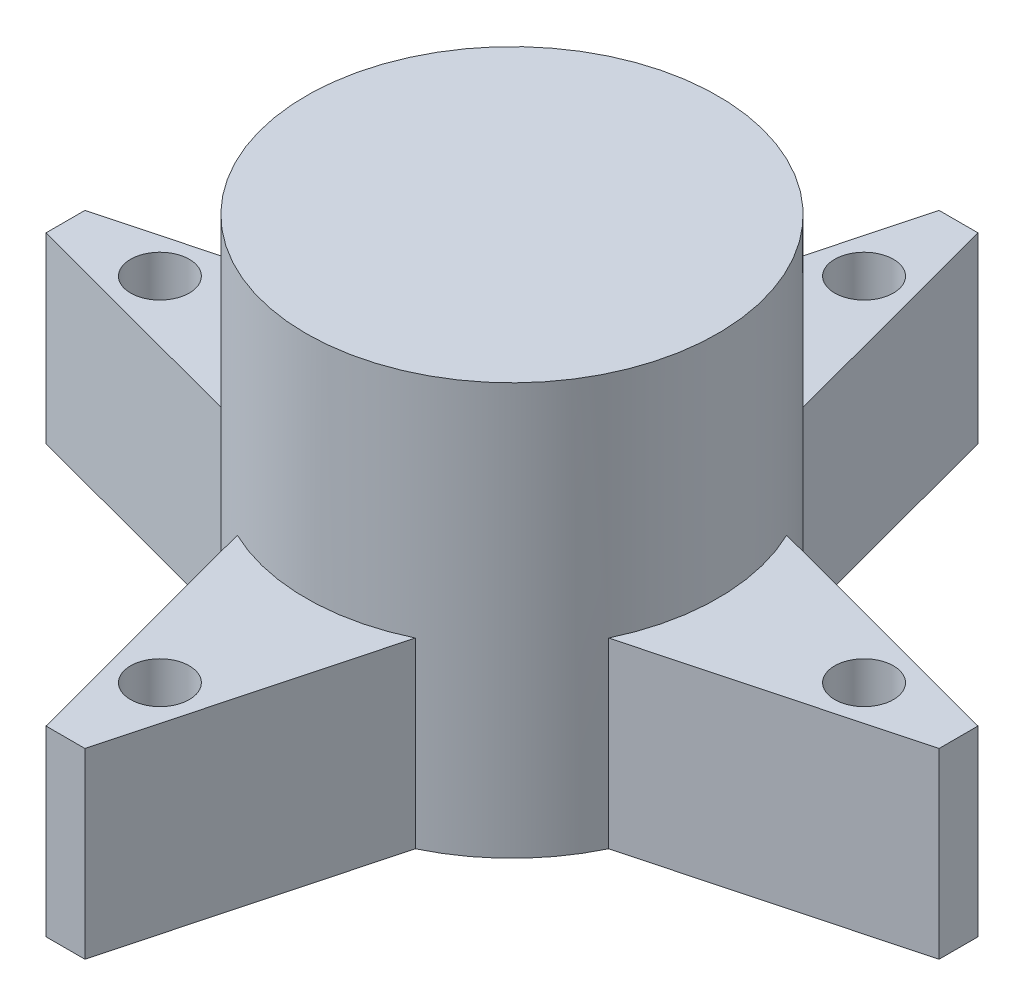
ISO-10303-21;
HEADER;
FILE_DESCRIPTION(('STEP AP214'),'2;1');
FILE_NAME('part.step','',(''),(''),'','','');
FILE_SCHEMA(('AUTOMOTIVE_DESIGN { 1 0 10303 214 1 1 1 1 }'));
ENDSEC;
DATA;
#1=APPLICATION_CONTEXT('core data for automotive mechanical design processes');
#2=APPLICATION_PROTOCOL_DEFINITION('international standard','automotive_design',2000,#1);
#3=PRODUCT_CONTEXT('',#1,'mechanical');
#4=PRODUCT('Part','Part','',(#3));
#5=PRODUCT_RELATED_PRODUCT_CATEGORY('part','',(#4));
#6=PRODUCT_DEFINITION_FORMATION('','',#4);
#7=PRODUCT_DEFINITION_CONTEXT('part definition',#1,'design');
#8=PRODUCT_DEFINITION('design','',#6,#7);
#9=PRODUCT_DEFINITION_SHAPE('','',#8);
#10=(LENGTH_UNIT() NAMED_UNIT(*) SI_UNIT(.MILLI.,.METRE.));
#11=(NAMED_UNIT(*) PLANE_ANGLE_UNIT() SI_UNIT($,.RADIAN.));
#12=(NAMED_UNIT(*) SI_UNIT($,.STERADIAN.) SOLID_ANGLE_UNIT());
#13=UNCERTAINTY_MEASURE_WITH_UNIT(LENGTH_MEASURE(1.E-05),#10,'distance_accuracy_value','');
#14=(GEOMETRIC_REPRESENTATION_CONTEXT(3) GLOBAL_UNCERTAINTY_ASSIGNED_CONTEXT((#13)) GLOBAL_UNIT_ASSIGNED_CONTEXT((#10,
#11,#12)) REPRESENTATION_CONTEXT('',''));
#15=CARTESIAN_POINT('',(0.,0.,0.));
#16=DIRECTION('',(0.,0.,1.));
#17=DIRECTION('',(1.,0.,0.));
#18=AXIS2_PLACEMENT_3D('',#15,#16,#17);
#19=CARTESIAN_POINT('',(0.,15.79,0.));
#20=DIRECTION('',(0.,-1.,0.));
#21=DIRECTION('',(0.,0.,-1.));
#22=AXIS2_PLACEMENT_3D('',#19,#20,#21);
#23=CYLINDRICAL_SURFACE('',#22,7.895);
#24=CARTESIAN_POINT('',(0.,15.79,0.));
#25=DIRECTION('',(0.,1.,0.));
#26=DIRECTION('',(0.,0.,1.));
#27=AXIS2_PLACEMENT_3D('',#24,#25,#26);
#28=CIRCLE('',#27,7.895);
#29=CARTESIAN_POINT('',(0.,15.79,7.895));
#30=VERTEX_POINT('',#29);
#31=EDGE_CURVE('E256',#30,#30,#28,.T.);
#32=ORIENTED_EDGE('',*,*,#31,.F.);
#33=EDGE_LOOP('',(#32));
#34=FACE_BOUND('',#33,.T.);
#35=DIRECTION('',(0.,-1.,0.));
#36=VECTOR('',#35,1.);
#37=CARTESIAN_POINT('',(7.1189256880961,7.,3.4134911816739));
#38=LINE('',#37,#36);
#39=CARTESIAN_POINT('',(7.1189256880961,7.,3.4134911816739));
#40=VERTEX_POINT('',#39);
#41=CARTESIAN_POINT('',(7.1189256880961,0.,3.4134911816739));
#42=VERTEX_POINT('',#41);
#43=EDGE_CURVE('E49',#40,#42,#38,.T.);
#44=ORIENTED_EDGE('',*,*,#43,.F.);
#45=CARTESIAN_POINT('',(0.,7.,0.));
#46=DIRECTION('',(0.,1.,0.));
#47=DIRECTION('',(0.,0.,1.));
#48=AXIS2_PLACEMENT_3D('',#45,#46,#47);
#49=CIRCLE('',#48,7.895);
#50=CARTESIAN_POINT('',(7.1189256880961,7.,-3.4134911816739));
#51=VERTEX_POINT('',#50);
#52=EDGE_CURVE('E11',#40,#51,#49,.T.);
#53=ORIENTED_EDGE('',*,*,#52,.T.);
#54=DIRECTION('',(0.,-1.,0.));
#55=VECTOR('',#54,1.);
#56=CARTESIAN_POINT('',(7.1189256880961,7.,-3.4134911816739));
#57=LINE('',#56,#55);
#58=CARTESIAN_POINT('',(7.1189256880961,0.,-3.41349118167389));
#59=VERTEX_POINT('',#58);
#60=EDGE_CURVE('E251',#51,#59,#57,.T.);
#61=ORIENTED_EDGE('',*,*,#60,.T.);
#62=CARTESIAN_POINT('',(0.,0.,0.));
#63=DIRECTION('',(0.,1.,0.));
#64=DIRECTION('',(0.,0.,1.));
#65=AXIS2_PLACEMENT_3D('',#62,#63,#64);
#66=CIRCLE('',#65,7.895);
#67=CARTESIAN_POINT('',(3.41349118167397,0.,-7.11892568809607));
#68=VERTEX_POINT('',#67);
#69=EDGE_CURVE('E259',#59,#68,#66,.T.);
#70=ORIENTED_EDGE('',*,*,#69,.T.);
#71=DIRECTION('',(0.,-1.,0.));
#72=VECTOR('',#71,1.);
#73=CARTESIAN_POINT('',(3.41349118167397,7.,-7.11892568809607));
#74=LINE('',#73,#72);
#75=CARTESIAN_POINT('',(3.41349118167397,7.,-7.11892568809606));
#76=VERTEX_POINT('',#75);
#77=EDGE_CURVE('E56',#76,#68,#74,.T.);
#78=ORIENTED_EDGE('',*,*,#77,.F.);
#79=CARTESIAN_POINT('',(-3.41349118167382,7.,-7.11892568809614));
#80=VERTEX_POINT('',#79);
#81=EDGE_CURVE('E43',#76,#80,#49,.T.);
#82=ORIENTED_EDGE('',*,*,#81,.T.);
#83=DIRECTION('',(0.,-1.,0.));
#84=VECTOR('',#83,1.);
#85=CARTESIAN_POINT('',(-3.41349118167382,7.,-7.11892568809614));
#86=LINE('',#85,#84);
#87=CARTESIAN_POINT('',(-3.41349118167382,0.,-7.11892568809614));
#88=VERTEX_POINT('',#87);
#89=EDGE_CURVE('E242',#80,#88,#86,.T.);
#90=ORIENTED_EDGE('',*,*,#89,.T.);
#91=CARTESIAN_POINT('',(-7.11892568809608,0.,-3.41349118167395));
#92=VERTEX_POINT('',#91);
#93=EDGE_CURVE('E261',#88,#92,#66,.T.);
#94=ORIENTED_EDGE('',*,*,#93,.T.);
#95=DIRECTION('',(0.,-1.,0.));
#96=VECTOR('',#95,1.);
#97=CARTESIAN_POINT('',(-7.11892568809608,7.,-3.41349118167394));
#98=LINE('',#97,#96);
#99=CARTESIAN_POINT('',(-7.11892568809608,7.,-3.41349118167395));
#100=VERTEX_POINT('',#99);
#101=EDGE_CURVE('E239',#100,#92,#98,.T.);
#102=ORIENTED_EDGE('',*,*,#101,.F.);
#103=CARTESIAN_POINT('',(-7.11892568809613,7.,3.41349118167385));
#104=VERTEX_POINT('',#103);
#105=EDGE_CURVE('E288',#100,#104,#49,.T.);
#106=ORIENTED_EDGE('',*,*,#105,.T.);
#107=DIRECTION('',(0.,-1.,0.));
#108=VECTOR('',#107,1.);
#109=CARTESIAN_POINT('',(-7.11892568809613,7.,3.41349118167385));
#110=LINE('',#109,#108);
#111=CARTESIAN_POINT('',(-7.11892568809612,0.,3.41349118167385));
#112=VERTEX_POINT('',#111);
#113=EDGE_CURVE('E231',#104,#112,#110,.T.);
#114=ORIENTED_EDGE('',*,*,#113,.T.);
#115=CARTESIAN_POINT('',(-3.41349118167392,0.,7.11892568809609));
#116=VERTEX_POINT('',#115);
#117=EDGE_CURVE('E255',#112,#116,#66,.T.);
#118=ORIENTED_EDGE('',*,*,#117,.T.);
#119=DIRECTION('',(0.,-1.,0.));
#120=VECTOR('',#119,1.);
#121=CARTESIAN_POINT('',(-3.41349118167392,7.,7.11892568809609));
#122=LINE('',#121,#120);
#123=CARTESIAN_POINT('',(-3.41349118167392,7.,7.11892568809609));
#124=VERTEX_POINT('',#123);
#125=EDGE_CURVE('E228',#124,#116,#122,.T.);
#126=ORIENTED_EDGE('',*,*,#125,.F.);
#127=CARTESIAN_POINT('',(3.41349118167387,7.,7.11892568809611));
#128=VERTEX_POINT('',#127);
#129=EDGE_CURVE('E38',#124,#128,#49,.T.);
#130=ORIENTED_EDGE('',*,*,#129,.T.);
#131=DIRECTION('',(0.,-1.,0.));
#132=VECTOR('',#131,1.);
#133=CARTESIAN_POINT('',(3.41349118167387,7.,7.11892568809611));
#134=LINE('',#133,#132);
#135=CARTESIAN_POINT('',(3.41349118167387,0.,7.11892568809611));
#136=VERTEX_POINT('',#135);
#137=EDGE_CURVE('E193',#128,#136,#134,.T.);
#138=ORIENTED_EDGE('',*,*,#137,.T.);
#139=EDGE_CURVE('E258',#136,#42,#66,.T.);
#140=ORIENTED_EDGE('',*,*,#139,.T.);
#141=EDGE_LOOP('',(#44,#53,#61,#70,#78,#82,#90,#94,#102,#106,#114,#118,#126,#130,#138,#140));
#142=FACE_BOUND('',#141,.T.);
#143=ADVANCED_FACE('F35',(#34,#142),#23,.T.);
#144=CARTESIAN_POINT('',(0.,15.79,0.));
#145=DIRECTION('',(0.,1.,0.));
#146=DIRECTION('',(0.,0.,1.));
#147=AXIS2_PLACEMENT_3D('',#144,#145,#146);
#148=PLANE('',#147);
#149=ORIENTED_EDGE('',*,*,#31,.T.);
#150=EDGE_LOOP('',(#149));
#151=FACE_BOUND('',#150,.T.);
#152=ADVANCED_FACE('F332',(#151),#148,.T.);
#153=CARTESIAN_POINT('',(0.,0.,0.));
#154=DIRECTION('',(0.,1.,0.));
#155=DIRECTION('',(0.,0.,1.));
#156=AXIS2_PLACEMENT_3D('',#153,#154,#155);
#157=PLANE('',#156);
#158=ORIENTED_EDGE('',*,*,#69,.F.);
#159=DIRECTION('',(-0.966238646711893,0.,-0.257648748493699));
#160=VECTOR('',#159,1.);
#161=CARTESIAN_POINT('',(17.1218358981437,0.,-0.746202613074476));
#162=LINE('',#161,#160);
#163=CARTESIAN_POINT('',(17.1218358981437,0.,-0.746202613074476));
#164=VERTEX_POINT('',#163);
#165=EDGE_CURVE('E198',#164,#59,#162,.T.);
#166=ORIENTED_EDGE('',*,*,#165,.F.);
#167=DIRECTION('',(0.,0.,-1.));
#168=VECTOR('',#167,1.);
#169=CARTESIAN_POINT('',(17.1218358981437,0.,0.746202613074476));
#170=LINE('',#169,#168);
#171=CARTESIAN_POINT('',(17.1218358981437,0.,0.746202613074476));
#172=VERTEX_POINT('',#171);
#173=EDGE_CURVE('E195',#172,#164,#170,.T.);
#174=ORIENTED_EDGE('',*,*,#173,.F.);
#175=DIRECTION('',(0.966238646711893,0.,-0.257648748493699));
#176=VECTOR('',#175,1.);
#177=CARTESIAN_POINT('',(7.1189256880961,0.,3.4134911816739));
#178=LINE('',#177,#176);
#179=EDGE_CURVE('E159',#42,#172,#178,.T.);
#180=ORIENTED_EDGE('',*,*,#179,.F.);
#181=ORIENTED_EDGE('',*,*,#139,.F.);
#182=DIRECTION('',(0.257648748493702,0.,-0.966238646711892));
#183=VECTOR('',#182,1.);
#184=CARTESIAN_POINT('',(0.746202613074416,0.,17.1218358981437));
#185=LINE('',#184,#183);
#186=CARTESIAN_POINT('',(0.746202613074416,0.,17.1218358981437));
#187=VERTEX_POINT('',#186);
#188=EDGE_CURVE('E153',#187,#136,#185,.T.);
#189=ORIENTED_EDGE('',*,*,#188,.F.);
#190=DIRECTION('',(1.,0.,0.));
#191=VECTOR('',#190,1.);
#192=CARTESIAN_POINT('',(-0.746202613074536,0.,17.1218358981437));
#193=LINE('',#192,#191);
#194=CARTESIAN_POINT('',(-0.746202613074536,0.,17.1218358981437));
#195=VERTEX_POINT('',#194);
#196=EDGE_CURVE('E217',#195,#187,#193,.T.);
#197=ORIENTED_EDGE('',*,*,#196,.F.);
#198=DIRECTION('',(0.257648748493695,0.,0.966238646711894));
#199=VECTOR('',#198,1.);
#200=CARTESIAN_POINT('',(-3.41349118167392,0.,7.11892568809609));
#201=LINE('',#200,#199);
#202=EDGE_CURVE('E215',#116,#195,#201,.T.);
#203=ORIENTED_EDGE('',*,*,#202,.F.);
#204=ORIENTED_EDGE('',*,*,#117,.F.);
#205=DIRECTION('',(0.966238646711892,0.,0.257648748493705));
#206=VECTOR('',#205,1.);
#207=CARTESIAN_POINT('',(-17.1218358981437,0.,0.746202613074357));
#208=LINE('',#207,#206);
#209=CARTESIAN_POINT('',(-17.1218358981437,0.,0.746202613074357));
#210=VERTEX_POINT('',#209);
#211=EDGE_CURVE('E212',#210,#112,#208,.T.);
#212=ORIENTED_EDGE('',*,*,#211,.F.);
#213=DIRECTION('',(0.,0.,1.));
#214=VECTOR('',#213,1.);
#215=CARTESIAN_POINT('',(-17.1218358981437,0.,-0.746202613074595));
#216=LINE('',#215,#214);
#217=CARTESIAN_POINT('',(-17.1218358981437,0.,-0.746202613074595));
#218=VERTEX_POINT('',#217);
#219=EDGE_CURVE('E210',#218,#210,#216,.T.);
#220=ORIENTED_EDGE('',*,*,#219,.F.);
#221=DIRECTION('',(-0.966238646711895,0.,0.257648748493692));
#222=VECTOR('',#221,1.);
#223=CARTESIAN_POINT('',(-7.11892568809608,0.,-3.41349118167394));
#224=LINE('',#223,#222);
#225=EDGE_CURVE('E208',#92,#218,#224,.T.);
#226=ORIENTED_EDGE('',*,*,#225,.F.);
#227=ORIENTED_EDGE('',*,*,#93,.F.);
#228=DIRECTION('',(-0.257648748493709,0.,0.966238646711891));
#229=VECTOR('',#228,1.);
#230=CARTESIAN_POINT('',(-0.746202613074297,0.,-17.1218358981437));
#231=LINE('',#230,#229);
#232=CARTESIAN_POINT('',(-0.746202613074297,0.,-17.1218358981437));
#233=VERTEX_POINT('',#232);
#234=EDGE_CURVE('E205',#233,#88,#231,.T.);
#235=ORIENTED_EDGE('',*,*,#234,.F.);
#236=DIRECTION('',(-1.,0.,0.));
#237=VECTOR('',#236,1.);
#238=CARTESIAN_POINT('',(0.746202613074655,0.,-17.1218358981437));
#239=LINE('',#238,#237);
#240=CARTESIAN_POINT('',(0.746202613074655,0.,-17.1218358981437));
#241=VERTEX_POINT('',#240);
#242=EDGE_CURVE('E203',#241,#233,#239,.T.);
#243=ORIENTED_EDGE('',*,*,#242,.F.);
#244=DIRECTION('',(-0.257648748493688,0.,-0.966238646711896));
#245=VECTOR('',#244,1.);
#246=CARTESIAN_POINT('',(3.41349118167397,0.,-7.11892568809607));
#247=LINE('',#246,#245);
#248=EDGE_CURVE('E201',#68,#241,#247,.T.);
#249=ORIENTED_EDGE('',*,*,#248,.F.);
#250=EDGE_LOOP('',(#158,#166,#174,#180,#181,#189,#197,#203,#204,#212,#220,#226,#227,#235,#243,#249));
#251=FACE_BOUND('',#250,.T.);
#252=CARTESIAN_POINT('',(0.,0.,13.5));
#253=DIRECTION('',(0.,1.,0.));
#254=DIRECTION('',(0.,0.,1.));
#255=AXIS2_PLACEMENT_3D('',#252,#253,#254);
#256=CIRCLE('',#255,1.125);
#257=CARTESIAN_POINT('',(0.,0.,14.625));
#258=VERTEX_POINT('',#257);
#259=EDGE_CURVE('E410',#258,#258,#256,.T.);
#260=ORIENTED_EDGE('',*,*,#259,.T.);
#261=EDGE_LOOP('',(#260));
#262=FACE_BOUND('',#261,.T.);
#263=CARTESIAN_POINT('',(-13.5,0.,0.));
#264=DIRECTION('',(0.,1.,0.));
#265=DIRECTION('',(0.,0.,1.));
#266=AXIS2_PLACEMENT_3D('',#263,#264,#265);
#267=CIRCLE('',#266,1.125);
#268=CARTESIAN_POINT('',(-13.5,0.,1.12499999999991));
#269=VERTEX_POINT('',#268);
#270=EDGE_CURVE('E400',#269,#269,#267,.T.);
#271=ORIENTED_EDGE('',*,*,#270,.T.);
#272=EDGE_LOOP('',(#271));
#273=FACE_BOUND('',#272,.T.);
#274=CARTESIAN_POINT('',(1.41404994223147E-13,0.,-13.5));
#275=DIRECTION('',(0.,1.,0.));
#276=DIRECTION('',(0.,0.,1.));
#277=AXIS2_PLACEMENT_3D('',#274,#275,#276);
#278=CIRCLE('',#277,1.125);
#279=CARTESIAN_POINT('',(1.41404994223147E-13,0.,-12.375));
#280=VERTEX_POINT('',#279);
#281=EDGE_CURVE('E401',#280,#280,#278,.T.);
#282=ORIENTED_EDGE('',*,*,#281,.T.);
#283=EDGE_LOOP('',(#282));
#284=FACE_BOUND('',#283,.T.);
#285=CARTESIAN_POINT('',(13.5,0.,0.));
#286=DIRECTION('',(0.,1.,0.));
#287=DIRECTION('',(0.,0.,1.));
#288=AXIS2_PLACEMENT_3D('',#285,#286,#287);
#289=CIRCLE('',#288,1.125);
#290=CARTESIAN_POINT('',(13.5,0.,1.125));
#291=VERTEX_POINT('',#290);
#292=EDGE_CURVE('E415',#291,#291,#289,.T.);
#293=ORIENTED_EDGE('',*,*,#292,.T.);
#294=EDGE_LOOP('',(#293));
#295=FACE_BOUND('',#294,.T.);
#296=ADVANCED_FACE('F275',(#251,#262,#273,#284,#295),#157,.F.);
#297=CARTESIAN_POINT('',(0.,7.,13.5));
#298=DIRECTION('',(0.,-1.,0.));
#299=DIRECTION('',(0.,0.,-1.));
#300=AXIS2_PLACEMENT_3D('',#297,#298,#299);
#301=CYLINDRICAL_SURFACE('',#300,1.125);
#302=CARTESIAN_POINT('',(0.,7.,13.5));
#303=DIRECTION('',(0.,1.,0.));
#304=DIRECTION('',(0.,0.,1.));
#305=AXIS2_PLACEMENT_3D('',#302,#303,#304);
#306=CIRCLE('',#305,1.125);
#307=CARTESIAN_POINT('',(0.,7.,14.625));
#308=VERTEX_POINT('',#307);
#309=EDGE_CURVE('E412',#308,#308,#306,.T.);
#310=ORIENTED_EDGE('',*,*,#309,.T.);
#311=EDGE_LOOP('',(#310));
#312=FACE_BOUND('',#311,.T.);
#313=ORIENTED_EDGE('',*,*,#259,.F.);
#314=EDGE_LOOP('',(#313));
#315=FACE_BOUND('',#314,.T.);
#316=ADVANCED_FACE('F343',(#312,#315),#301,.F.);
#317=CARTESIAN_POINT('',(-0.746202613074536,7.,17.1218358981437));
#318=DIRECTION('',(0.,0.,-1.));
#319=DIRECTION('',(-1.,0.,0.));
#320=AXIS2_PLACEMENT_3D('',#317,#318,#319);
#321=PLANE('',#320);
#322=ORIENTED_EDGE('',*,*,#196,.T.);
#323=DIRECTION('',(0.,-1.,0.));
#324=VECTOR('',#323,1.);
#325=CARTESIAN_POINT('',(0.746202613074416,7.,17.1218358981437));
#326=LINE('',#325,#324);
#327=CARTESIAN_POINT('',(0.746202613074416,7.,17.1218358981437));
#328=VERTEX_POINT('',#327);
#329=EDGE_CURVE('E222',#328,#187,#326,.T.);
#330=ORIENTED_EDGE('',*,*,#329,.F.);
#331=DIRECTION('',(1.,0.,0.));
#332=VECTOR('',#331,1.);
#333=CARTESIAN_POINT('',(-0.746202613074536,7.,17.1218358981437));
#334=LINE('',#333,#332);
#335=CARTESIAN_POINT('',(-0.746202613074536,7.,17.1218358981437));
#336=VERTEX_POINT('',#335);
#337=EDGE_CURVE('E188',#336,#328,#334,.T.);
#338=ORIENTED_EDGE('',*,*,#337,.F.);
#339=DIRECTION('',(0.,-1.,0.));
#340=VECTOR('',#339,1.);
#341=CARTESIAN_POINT('',(-0.746202613074536,7.,17.1218358981437));
#342=LINE('',#341,#340);
#343=EDGE_CURVE('E225',#336,#195,#342,.T.);
#344=ORIENTED_EDGE('',*,*,#343,.T.);
#345=EDGE_LOOP('',(#322,#330,#338,#344));
#346=FACE_BOUND('',#345,.T.);
#347=ADVANCED_FACE('F369',(#346),#321,.F.);
#348=CARTESIAN_POINT('',(0.746202613074416,7.,17.1218358981437));
#349=DIRECTION('',(-0.966238646711892,0.,-0.257648748493702));
#350=DIRECTION('',(-0.257648748493702,0.,0.966238646711892));
#351=AXIS2_PLACEMENT_3D('',#348,#349,#350);
#352=PLANE('',#351);
#353=ORIENTED_EDGE('',*,*,#188,.T.);
#354=ORIENTED_EDGE('',*,*,#137,.F.);
#355=DIRECTION('',(0.257648748493702,0.,-0.966238646711892));
#356=VECTOR('',#355,1.);
#357=CARTESIAN_POINT('',(0.746202613074416,7.,17.1218358981437));
#358=LINE('',#357,#356);
#359=EDGE_CURVE('E190',#328,#128,#358,.T.);
#360=ORIENTED_EDGE('',*,*,#359,.F.);
#361=ORIENTED_EDGE('',*,*,#329,.T.);
#362=EDGE_LOOP('',(#353,#354,#360,#361));
#363=FACE_BOUND('',#362,.T.);
#364=ADVANCED_FACE('F298',(#363),#352,.F.);
#365=CARTESIAN_POINT('',(-3.41349118167392,7.,7.11892568809609));
#366=DIRECTION('',(0.966238646711894,0.,-0.257648748493695));
#367=DIRECTION('',(-0.257648748493695,0.,-0.966238646711894));
#368=AXIS2_PLACEMENT_3D('',#365,#366,#367);
#369=PLANE('',#368);
#370=ORIENTED_EDGE('',*,*,#202,.T.);
#371=ORIENTED_EDGE('',*,*,#343,.F.);
#372=DIRECTION('',(0.257648748493695,0.,0.966238646711894));
#373=VECTOR('',#372,1.);
#374=CARTESIAN_POINT('',(-3.41349118167392,7.,7.11892568809609));
#375=LINE('',#374,#373);
#376=EDGE_CURVE('E186',#124,#336,#375,.T.);
#377=ORIENTED_EDGE('',*,*,#376,.F.);
#378=ORIENTED_EDGE('',*,*,#125,.T.);
#379=EDGE_LOOP('',(#370,#371,#377,#378));
#380=FACE_BOUND('',#379,.T.);
#381=ADVANCED_FACE('F368',(#380),#369,.F.);
#382=CARTESIAN_POINT('',(0.,7.,0.));
#383=DIRECTION('',(0.,1.,0.));
#384=DIRECTION('',(0.,0.,1.));
#385=AXIS2_PLACEMENT_3D('',#382,#383,#384);
#386=PLANE('',#385);
#387=ORIENTED_EDGE('',*,*,#309,.F.);
#388=EDGE_LOOP('',(#387));
#389=FACE_BOUND('',#388,.T.);
#390=ORIENTED_EDGE('',*,*,#129,.F.);
#391=ORIENTED_EDGE('',*,*,#376,.T.);
#392=ORIENTED_EDGE('',*,*,#337,.T.);
#393=ORIENTED_EDGE('',*,*,#359,.T.);
#394=EDGE_LOOP('',(#390,#391,#392,#393));
#395=FACE_BOUND('',#394,.T.);
#396=ADVANCED_FACE('F294',(#389,#395),#386,.T.);
#397=CARTESIAN_POINT('',(-13.5,7.,0.));
#398=DIRECTION('',(0.,-1.,0.));
#399=DIRECTION('',(0.,0.,-1.));
#400=AXIS2_PLACEMENT_3D('',#397,#398,#399);
#401=CYLINDRICAL_SURFACE('',#400,1.125);
#402=CARTESIAN_POINT('',(-13.5,7.,0.));
#403=DIRECTION('',(0.,1.,0.));
#404=DIRECTION('',(0.,0.,1.));
#405=AXIS2_PLACEMENT_3D('',#402,#403,#404);
#406=CIRCLE('',#405,1.125);
#407=CARTESIAN_POINT('',(-13.5,7.,1.12499999999991));
#408=VERTEX_POINT('',#407);
#409=EDGE_CURVE('E404',#408,#408,#406,.T.);
#410=ORIENTED_EDGE('',*,*,#409,.T.);
#411=EDGE_LOOP('',(#410));
#412=FACE_BOUND('',#411,.T.);
#413=ORIENTED_EDGE('',*,*,#270,.F.);
#414=EDGE_LOOP('',(#413));
#415=FACE_BOUND('',#414,.T.);
#416=ADVANCED_FACE('F379',(#412,#415),#401,.F.);
#417=CARTESIAN_POINT('',(-17.1218358981437,7.,-0.746202613074595));
#418=DIRECTION('',(1.,0.,0.));
#419=DIRECTION('',(0.,0.,-1.));
#420=AXIS2_PLACEMENT_3D('',#417,#418,#419);
#421=PLANE('',#420);
#422=ORIENTED_EDGE('',*,*,#219,.T.);
#423=DIRECTION('',(0.,-1.,0.));
#424=VECTOR('',#423,1.);
#425=CARTESIAN_POINT('',(-17.1218358981437,7.,0.746202613074357));
#426=LINE('',#425,#424);
#427=CARTESIAN_POINT('',(-17.1218358981437,7.,0.746202613074357));
#428=VERTEX_POINT('',#427);
#429=EDGE_CURVE('E233',#428,#210,#426,.T.);
#430=ORIENTED_EDGE('',*,*,#429,.F.);
#431=DIRECTION('',(0.,0.,1.));
#432=VECTOR('',#431,1.);
#433=CARTESIAN_POINT('',(-17.1218358981437,7.,-0.746202613074595));
#434=LINE('',#433,#432);
#435=CARTESIAN_POINT('',(-17.1218358981437,7.,-0.746202613074595));
#436=VERTEX_POINT('',#435);
#437=EDGE_CURVE('E181',#436,#428,#434,.T.);
#438=ORIENTED_EDGE('',*,*,#437,.F.);
#439=DIRECTION('',(0.,-1.,0.));
#440=VECTOR('',#439,1.);
#441=CARTESIAN_POINT('',(-17.1218358981437,7.,-0.746202613074595));
#442=LINE('',#441,#440);
#443=EDGE_CURVE('E236',#436,#218,#442,.T.);
#444=ORIENTED_EDGE('',*,*,#443,.T.);
#445=EDGE_LOOP('',(#422,#430,#438,#444));
#446=FACE_BOUND('',#445,.T.);
#447=ADVANCED_FACE('F280',(#446),#421,.F.);
#448=CARTESIAN_POINT('',(-17.1218358981437,7.,0.746202613074357));
#449=DIRECTION('',(0.257648748493705,0.,-0.966238646711891));
#450=DIRECTION('',(-0.966238646711891,0.,-0.257648748493705));
#451=AXIS2_PLACEMENT_3D('',#448,#449,#450);
#452=PLANE('',#451);
#453=ORIENTED_EDGE('',*,*,#211,.T.);
#454=ORIENTED_EDGE('',*,*,#113,.F.);
#455=DIRECTION('',(0.966238646711892,0.,0.257648748493705));
#456=VECTOR('',#455,1.);
#457=CARTESIAN_POINT('',(-17.1218358981437,7.,0.746202613074357));
#458=LINE('',#457,#456);
#459=EDGE_CURVE('E183',#428,#104,#458,.T.);
#460=ORIENTED_EDGE('',*,*,#459,.F.);
#461=ORIENTED_EDGE('',*,*,#429,.T.);
#462=EDGE_LOOP('',(#453,#454,#460,#461));
#463=FACE_BOUND('',#462,.T.);
#464=ADVANCED_FACE('F284',(#463),#452,.F.);
#465=CARTESIAN_POINT('',(-7.11892568809608,7.,-3.41349118167394));
#466=DIRECTION('',(0.257648748493692,0.,0.966238646711895));
#467=DIRECTION('',(0.966238646711895,0.,-0.257648748493692));
#468=AXIS2_PLACEMENT_3D('',#465,#466,#467);
#469=PLANE('',#468);
#470=ORIENTED_EDGE('',*,*,#225,.T.);
#471=ORIENTED_EDGE('',*,*,#443,.F.);
#472=DIRECTION('',(-0.966238646711895,0.,0.257648748493692));
#473=VECTOR('',#472,1.);
#474=CARTESIAN_POINT('',(-7.11892568809608,7.,-3.41349118167394));
#475=LINE('',#474,#473);
#476=EDGE_CURVE('E179',#100,#436,#475,.T.);
#477=ORIENTED_EDGE('',*,*,#476,.F.);
#478=ORIENTED_EDGE('',*,*,#101,.T.);
#479=EDGE_LOOP('',(#470,#471,#477,#478));
#480=FACE_BOUND('',#479,.T.);
#481=ADVANCED_FACE('F271',(#480),#469,.F.);
#482=ORIENTED_EDGE('',*,*,#409,.F.);
#483=EDGE_LOOP('',(#482));
#484=FACE_BOUND('',#483,.T.);
#485=ORIENTED_EDGE('',*,*,#105,.F.);
#486=ORIENTED_EDGE('',*,*,#476,.T.);
#487=ORIENTED_EDGE('',*,*,#437,.T.);
#488=ORIENTED_EDGE('',*,*,#459,.T.);
#489=EDGE_LOOP('',(#485,#486,#487,#488));
#490=FACE_BOUND('',#489,.T.);
#491=ADVANCED_FACE('F287',(#484,#490),#386,.T.);
#492=CARTESIAN_POINT('',(1.41404994223147E-13,7.,-13.5));
#493=DIRECTION('',(0.,-1.,0.));
#494=DIRECTION('',(0.,0.,-1.));
#495=AXIS2_PLACEMENT_3D('',#492,#493,#494);
#496=CYLINDRICAL_SURFACE('',#495,1.125);
#497=CARTESIAN_POINT('',(1.41404994223147E-13,7.,-13.5));
#498=DIRECTION('',(0.,1.,0.));
#499=DIRECTION('',(0.,0.,1.));
#500=AXIS2_PLACEMENT_3D('',#497,#498,#499);
#501=CIRCLE('',#500,1.125);
#502=CARTESIAN_POINT('',(1.41404994223147E-13,7.,-12.375));
#503=VERTEX_POINT('',#502);
#504=EDGE_CURVE('E399',#503,#503,#501,.T.);
#505=ORIENTED_EDGE('',*,*,#504,.T.);
#506=EDGE_LOOP('',(#505));
#507=FACE_BOUND('',#506,.T.);
#508=ORIENTED_EDGE('',*,*,#281,.F.);
#509=EDGE_LOOP('',(#508));
#510=FACE_BOUND('',#509,.T.);
#511=ADVANCED_FACE('F328',(#507,#510),#496,.F.);
#512=CARTESIAN_POINT('',(0.746202613074655,7.,-17.1218358981437));
#513=DIRECTION('',(0.,0.,1.));
#514=DIRECTION('',(1.,0.,0.));
#515=AXIS2_PLACEMENT_3D('',#512,#513,#514);
#516=PLANE('',#515);
#517=ORIENTED_EDGE('',*,*,#242,.T.);
#518=DIRECTION('',(0.,-1.,0.));
#519=VECTOR('',#518,1.);
#520=CARTESIAN_POINT('',(-0.746202613074297,7.,-17.1218358981437));
#521=LINE('',#520,#519);
#522=CARTESIAN_POINT('',(-0.746202613074297,7.,-17.1218358981437));
#523=VERTEX_POINT('',#522);
#524=EDGE_CURVE('E244',#523,#233,#521,.T.);
#525=ORIENTED_EDGE('',*,*,#524,.F.);
#526=DIRECTION('',(-1.,0.,0.));
#527=VECTOR('',#526,1.);
#528=CARTESIAN_POINT('',(0.746202613074655,7.,-17.1218358981437));
#529=LINE('',#528,#527);
#530=CARTESIAN_POINT('',(0.746202613074655,7.,-17.1218358981437));
#531=VERTEX_POINT('',#530);
#532=EDGE_CURVE('E174',#531,#523,#529,.T.);
#533=ORIENTED_EDGE('',*,*,#532,.F.);
#534=DIRECTION('',(0.,-1.,0.));
#535=VECTOR('',#534,1.);
#536=CARTESIAN_POINT('',(0.746202613074655,7.,-17.1218358981437));
#537=LINE('',#536,#535);
#538=EDGE_CURVE('E247',#531,#241,#537,.T.);
#539=ORIENTED_EDGE('',*,*,#538,.T.);
#540=EDGE_LOOP('',(#517,#525,#533,#539));
#541=FACE_BOUND('',#540,.T.);
#542=ADVANCED_FACE('F314',(#541),#516,.F.);
#543=CARTESIAN_POINT('',(-0.746202613074297,7.,-17.1218358981437));
#544=DIRECTION('',(0.96623864671189,0.,0.257648748493709));
#545=DIRECTION('',(0.257648748493709,0.,-0.966238646711891));
#546=AXIS2_PLACEMENT_3D('',#543,#544,#545);
#547=PLANE('',#546);
#548=ORIENTED_EDGE('',*,*,#234,.T.);
#549=ORIENTED_EDGE('',*,*,#89,.F.);
#550=DIRECTION('',(-0.257648748493709,0.,0.966238646711891));
#551=VECTOR('',#550,1.);
#552=CARTESIAN_POINT('',(-0.746202613074297,7.,-17.1218358981437));
#553=LINE('',#552,#551);
#554=EDGE_CURVE('E176',#523,#80,#553,.T.);
#555=ORIENTED_EDGE('',*,*,#554,.F.);
#556=ORIENTED_EDGE('',*,*,#524,.T.);
#557=EDGE_LOOP('',(#548,#549,#555,#556));
#558=FACE_BOUND('',#557,.T.);
#559=ADVANCED_FACE('F320',(#558),#547,.F.);
#560=CARTESIAN_POINT('',(3.41349118167397,7.,-7.11892568809607));
#561=DIRECTION('',(-0.966238646711896,0.,0.257648748493688));
#562=DIRECTION('',(0.257648748493688,0.,0.966238646711896));
#563=AXIS2_PLACEMENT_3D('',#560,#561,#562);
#564=PLANE('',#563);
#565=ORIENTED_EDGE('',*,*,#248,.T.);
#566=ORIENTED_EDGE('',*,*,#538,.F.);
#567=DIRECTION('',(-0.257648748493688,0.,-0.966238646711896));
#568=VECTOR('',#567,1.);
#569=CARTESIAN_POINT('',(3.41349118167397,7.,-7.11892568809607));
#570=LINE('',#569,#568);
#571=EDGE_CURVE('E169',#76,#531,#570,.T.);
#572=ORIENTED_EDGE('',*,*,#571,.F.);
#573=ORIENTED_EDGE('',*,*,#77,.T.);
#574=EDGE_LOOP('',(#565,#566,#572,#573));
#575=FACE_BOUND('',#574,.T.);
#576=ADVANCED_FACE('F310',(#575),#564,.F.);
#577=ORIENTED_EDGE('',*,*,#504,.F.);
#578=EDGE_LOOP('',(#577));
#579=FACE_BOUND('',#578,.T.);
#580=ORIENTED_EDGE('',*,*,#81,.F.);
#581=ORIENTED_EDGE('',*,*,#571,.T.);
#582=ORIENTED_EDGE('',*,*,#532,.T.);
#583=ORIENTED_EDGE('',*,*,#554,.T.);
#584=EDGE_LOOP('',(#580,#581,#582,#583));
#585=FACE_BOUND('',#584,.T.);
#586=ADVANCED_FACE('F318',(#579,#585),#386,.T.);
#587=CARTESIAN_POINT('',(13.5,7.,0.));
#588=DIRECTION('',(0.,1.,0.));
#589=DIRECTION('',(0.,0.,1.));
#590=AXIS2_PLACEMENT_3D('',#587,#588,#589);
#591=CIRCLE('',#590,1.125);
#592=CARTESIAN_POINT('',(13.5,7.,1.125));
#593=VERTEX_POINT('',#592);
#594=EDGE_CURVE('E196',#593,#593,#591,.T.);
#595=ORIENTED_EDGE('',*,*,#594,.F.);
#596=EDGE_LOOP('',(#595));
#597=FACE_BOUND('',#596,.T.);
#598=ORIENTED_EDGE('',*,*,#52,.F.);
#599=DIRECTION('',(0.966238646711893,0.,-0.257648748493699));
#600=VECTOR('',#599,1.);
#601=CARTESIAN_POINT('',(7.1189256880961,7.,3.4134911816739));
#602=LINE('',#601,#600);
#603=CARTESIAN_POINT('',(17.1218358981437,7.,0.746202613074476));
#604=VERTEX_POINT('',#603);
#605=EDGE_CURVE('E145',#40,#604,#602,.T.);
#606=ORIENTED_EDGE('',*,*,#605,.T.);
#607=DIRECTION('',(0.,0.,-1.));
#608=VECTOR('',#607,1.);
#609=CARTESIAN_POINT('',(17.1218358981437,7.,0.746202613074476));
#610=LINE('',#609,#608);
#611=CARTESIAN_POINT('',(17.1218358981437,7.,-0.746202613074476));
#612=VERTEX_POINT('',#611);
#613=EDGE_CURVE('E150',#604,#612,#610,.T.);
#614=ORIENTED_EDGE('',*,*,#613,.T.);
#615=DIRECTION('',(-0.966238646711893,0.,-0.257648748493699));
#616=VECTOR('',#615,1.);
#617=CARTESIAN_POINT('',(17.1218358981437,7.,-0.746202613074476));
#618=LINE('',#617,#616);
#619=EDGE_CURVE('E167',#612,#51,#618,.T.);
#620=ORIENTED_EDGE('',*,*,#619,.T.);
#621=EDGE_LOOP('',(#598,#606,#614,#620));
#622=FACE_BOUND('',#621,.T.);
#623=ADVANCED_FACE('F147',(#597,#622),#386,.T.);
#624=CARTESIAN_POINT('',(7.1189256880961,7.,3.4134911816739));
#625=DIRECTION('',(-0.257648748493699,0.,-0.966238646711893));
#626=DIRECTION('',(-0.966238646711893,0.,0.257648748493699));
#627=AXIS2_PLACEMENT_3D('',#624,#625,#626);
#628=PLANE('',#627);
#629=ORIENTED_EDGE('',*,*,#179,.T.);
#630=DIRECTION('',(0.,-1.,0.));
#631=VECTOR('',#630,1.);
#632=CARTESIAN_POINT('',(17.1218358981437,7.,0.746202613074476));
#633=LINE('',#632,#631);
#634=EDGE_CURVE('E156',#604,#172,#633,.T.);
#635=ORIENTED_EDGE('',*,*,#634,.F.);
#636=ORIENTED_EDGE('',*,*,#605,.F.);
#637=ORIENTED_EDGE('',*,*,#43,.T.);
#638=EDGE_LOOP('',(#629,#635,#636,#637));
#639=FACE_BOUND('',#638,.T.);
#640=ADVANCED_FACE('F157',(#639),#628,.F.);
#641=CARTESIAN_POINT('',(17.1218358981437,7.,0.746202613074476));
#642=DIRECTION('',(-1.,0.,0.));
#643=DIRECTION('',(0.,0.,1.));
#644=AXIS2_PLACEMENT_3D('',#641,#642,#643);
#645=PLANE('',#644);
#646=ORIENTED_EDGE('',*,*,#173,.T.);
#647=DIRECTION('',(0.,-1.,0.));
#648=VECTOR('',#647,1.);
#649=CARTESIAN_POINT('',(17.1218358981437,7.,-0.746202613074476));
#650=LINE('',#649,#648);
#651=EDGE_CURVE('E162',#612,#164,#650,.T.);
#652=ORIENTED_EDGE('',*,*,#651,.F.);
#653=ORIENTED_EDGE('',*,*,#613,.F.);
#654=ORIENTED_EDGE('',*,*,#634,.T.);
#655=EDGE_LOOP('',(#646,#652,#653,#654));
#656=FACE_BOUND('',#655,.T.);
#657=ADVANCED_FACE('F164',(#656),#645,.F.);
#658=CARTESIAN_POINT('',(17.1218358981437,7.,-0.746202613074476));
#659=DIRECTION('',(-0.257648748493699,0.,0.966238646711893));
#660=DIRECTION('',(0.966238646711893,0.,0.257648748493699));
#661=AXIS2_PLACEMENT_3D('',#658,#659,#660);
#662=PLANE('',#661);
#663=ORIENTED_EDGE('',*,*,#165,.T.);
#664=ORIENTED_EDGE('',*,*,#60,.F.);
#665=ORIENTED_EDGE('',*,*,#619,.F.);
#666=ORIENTED_EDGE('',*,*,#651,.T.);
#667=EDGE_LOOP('',(#663,#664,#665,#666));
#668=FACE_BOUND('',#667,.T.);
#669=ADVANCED_FACE('F304',(#668),#662,.F.);
#670=CARTESIAN_POINT('',(13.5,7.,0.));
#671=DIRECTION('',(0.,-1.,0.));
#672=DIRECTION('',(0.,0.,-1.));
#673=AXIS2_PLACEMENT_3D('',#670,#671,#672);
#674=CYLINDRICAL_SURFACE('',#673,1.125);
#675=ORIENTED_EDGE('',*,*,#594,.T.);
#676=EDGE_LOOP('',(#675));
#677=FACE_BOUND('',#676,.T.);
#678=ORIENTED_EDGE('',*,*,#292,.F.);
#679=EDGE_LOOP('',(#678));
#680=FACE_BOUND('',#679,.T.);
#681=ADVANCED_FACE('F350',(#677,#680),#674,.F.);
#682=CLOSED_SHELL('',(#143,#152,#296,#316,#347,#364,#381,#396,#416,#447,#464,#481,#491,#511,
#542,#559,#576,#586,#623,#640,#657,#669,#681));
#683=MANIFOLD_SOLID_BREP('B2',#682);
#684=ADVANCED_BREP_SHAPE_REPRESENTATION('',(#18,#683),#14);
#685=SHAPE_DEFINITION_REPRESENTATION(#9,#684);
ENDSEC;
END-ISO-10303-21;
